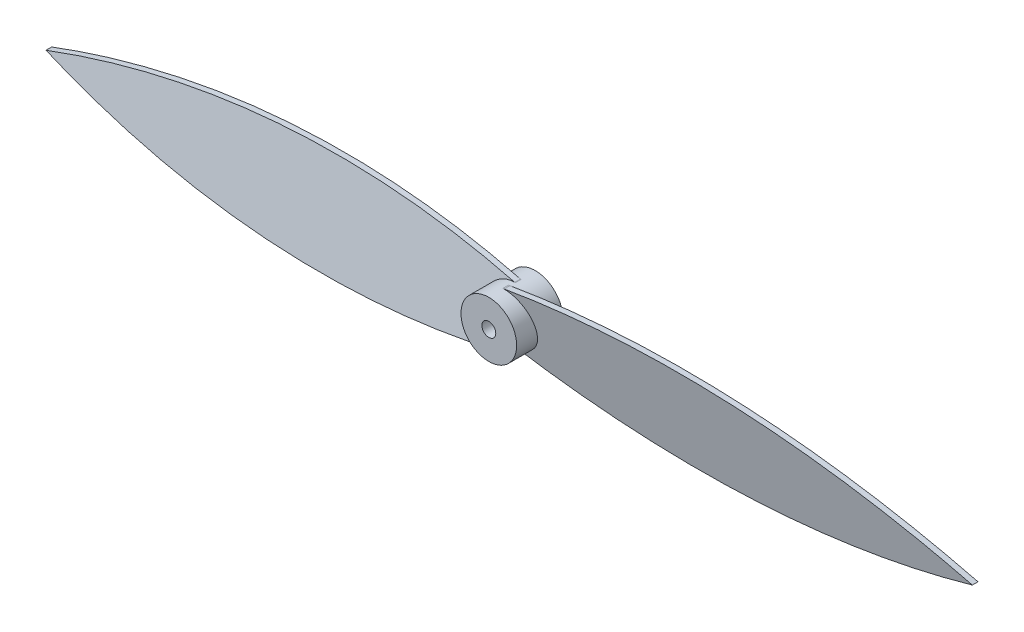
ISO-10303-21;
HEADER;
FILE_DESCRIPTION(('STEP AP214'),'2;1');
FILE_NAME('part.step','',(''),(''),'','','');
FILE_SCHEMA(('AUTOMOTIVE_DESIGN { 1 0 10303 214 1 1 1 1 }'));
ENDSEC;
DATA;
#1=APPLICATION_CONTEXT('core data for automotive mechanical design processes');
#2=APPLICATION_PROTOCOL_DEFINITION('international standard','automotive_design',2000,#1);
#3=PRODUCT_CONTEXT('',#1,'mechanical');
#4=PRODUCT('Part','Part','',(#3));
#5=PRODUCT_RELATED_PRODUCT_CATEGORY('part','',(#4));
#6=PRODUCT_DEFINITION_FORMATION('','',#4);
#7=PRODUCT_DEFINITION_CONTEXT('part definition',#1,'design');
#8=PRODUCT_DEFINITION('design','',#6,#7);
#9=PRODUCT_DEFINITION_SHAPE('','',#8);
#10=(LENGTH_UNIT() NAMED_UNIT(*) SI_UNIT(.MILLI.,.METRE.));
#11=(NAMED_UNIT(*) PLANE_ANGLE_UNIT() SI_UNIT($,.RADIAN.));
#12=(NAMED_UNIT(*) SI_UNIT($,.STERADIAN.) SOLID_ANGLE_UNIT());
#13=UNCERTAINTY_MEASURE_WITH_UNIT(LENGTH_MEASURE(1.E-05),#10,'distance_accuracy_value','');
#14=(GEOMETRIC_REPRESENTATION_CONTEXT(3) GLOBAL_UNCERTAINTY_ASSIGNED_CONTEXT((#13)) GLOBAL_UNIT_ASSIGNED_CONTEXT((#10,
#11,#12)) REPRESENTATION_CONTEXT('',''));
#15=CARTESIAN_POINT('',(0.,0.,0.));
#16=DIRECTION('',(0.,0.,1.));
#17=DIRECTION('',(1.,0.,0.));
#18=AXIS2_PLACEMENT_3D('',#15,#16,#17);
#19=CARTESIAN_POINT('',(125.,189.733037880005,0.588348405414554));
#20=DIRECTION('',(0.,0.196116135138184,-0.98058067569092));
#21=DIRECTION('',(0.,0.98058067569092,0.196116135138184));
#22=AXIS2_PLACEMENT_3D('',#19,#20,#21);
#23=PLANE('',#22);
#24=DIRECTION('',(-1.,0.,0.));
#25=VECTOR('',#24,1.);
#26=CARTESIAN_POINT('',(125.,158.850707561088,-5.58811765836887));
#27=LINE('',#26,#25);
#28=CARTESIAN_POINT('',(0.279977540218273,158.850707561088,-5.58811765836887));
#29=VERTEX_POINT('',#28);
#30=CARTESIAN_POINT('',(0.139988770109136,158.850707561088,-5.58811765836887));
#31=VERTEX_POINT('',#30);
#32=EDGE_CURVE('E211',#29,#31,#27,.T.);
#33=ORIENTED_EDGE('',*,*,#32,.F.);
#34=DIRECTION('',(0.,0.98058067569092,0.196116135138184));
#35=VECTOR('',#34,1.);
#36=CARTESIAN_POINT('',(0.279977540218274,189.733037880005,0.588348405414554));
#37=LINE('',#36,#35);
#38=CARTESIAN_POINT('',(0.279977540218274,158.821989157355,-5.59386133911546));
#39=VERTEX_POINT('',#38);
#40=EDGE_CURVE('E371',#39,#29,#37,.T.);
#41=ORIENTED_EDGE('',*,*,#40,.F.);
#42=CARTESIAN_POINT('',(38.915085389804,347.505597150109,32.1428602594354));
#43=DIRECTION('',(0.,0.196116135138184,-0.98058067569092));
#44=DIRECTION('',(0.,0.98058067569092,0.196116135138184));
#45=AXIS2_PLACEMENT_3D('',#42,#43,#44);
#46=ELLIPSE('',#45,196.412684170501,192.598482558177);
#47=CARTESIAN_POINT('',(100.,164.850707561088,-4.38811765836887));
#48=VERTEX_POINT('',#47);
#49=EDGE_CURVE('E438',#48,#39,#46,.T.);
#50=ORIENTED_EDGE('',*,*,#49,.F.);
#51=CARTESIAN_POINT('',(38.915085389804,-17.8041820279334,-40.9190955761731));
#52=DIRECTION('',(0.,0.196116135138184,-0.98058067569092));
#53=DIRECTION('',(0.,0.98058067569092,0.196116135138184));
#54=AXIS2_PLACEMENT_3D('',#51,#52,#53);
#55=ELLIPSE('',#54,196.412684170501,192.598482558177);
#56=CARTESIAN_POINT('',(0.279977540218274,170.879425964821,-3.18237397762226));
#57=VERTEX_POINT('',#56);
#58=EDGE_CURVE('E458',#48,#57,#55,.F.);
#59=ORIENTED_EDGE('',*,*,#58,.T.);
#60=DIRECTION('',(0.,0.98058067569092,0.196116135138184));
#61=VECTOR('',#60,1.);
#62=CARTESIAN_POINT('',(0.279977540218274,189.733037880005,0.588348405414554));
#63=LINE('',#62,#61);
#64=CARTESIAN_POINT('',(0.279977540218273,170.850707561088,-3.18811765836887));
#65=VERTEX_POINT('',#64);
#66=EDGE_CURVE('E377',#65,#57,#63,.T.);
#67=ORIENTED_EDGE('',*,*,#66,.F.);
#68=DIRECTION('',(1.,0.,0.));
#69=VECTOR('',#68,1.);
#70=CARTESIAN_POINT('',(125.,170.850707561088,-3.18811765836887));
#71=LINE('',#70,#69);
#72=CARTESIAN_POINT('',(0.139988770109136,170.850707561088,-3.18811765836887));
#73=VERTEX_POINT('',#72);
#74=EDGE_CURVE('E384',#73,#65,#71,.T.);
#75=ORIENTED_EDGE('',*,*,#74,.F.);
#76=CARTESIAN_POINT('',(0.139988770109136,164.850707561088,-4.38811765836887));
#77=DIRECTION('',(0.,0.196116135138184,-0.98058067569092));
#78=DIRECTION('',(0.,0.98058067569092,0.196116135138184));
#79=AXIS2_PLACEMENT_3D('',#76,#77,#78);
#80=ELLIPSE('',#79,6.11882341631134,6.);
#81=EDGE_CURVE('E244',#31,#73,#80,.F.);
#82=ORIENTED_EDGE('',*,*,#81,.F.);
#83=EDGE_LOOP('',(#33,#41,#50,#59,#67,#75,#82));
#84=FACE_BOUND('',#83,.T.);
#85=ADVANCED_FACE('F34',(#84),#23,.F.);
#86=CARTESIAN_POINT('',(125.,189.968377242171,-0.58834840541455));
#87=DIRECTION('',(0.,-0.196116135138184,0.98058067569092));
#88=DIRECTION('',(0.,-0.98058067569092,-0.196116135138184));
#89=AXIS2_PLACEMENT_3D('',#86,#87,#88);
#90=PLANE('',#89);
#91=DIRECTION('',(1.,0.,0.));
#92=VECTOR('',#91,1.);
#93=CARTESIAN_POINT('',(125.,158.850707561088,-6.81188234163113));
#94=LINE('',#93,#92);
#95=CARTESIAN_POINT('',(0.139988770109136,158.850707561088,-6.81188234163113));
#96=VERTEX_POINT('',#95);
#97=CARTESIAN_POINT('',(0.279977540218273,158.850707561088,-6.81188234163113));
#98=VERTEX_POINT('',#97);
#99=EDGE_CURVE('E199',#96,#98,#94,.T.);
#100=ORIENTED_EDGE('',*,*,#99,.F.);
#101=CARTESIAN_POINT('',(0.139988770109136,164.850707561088,-5.61188234163113));
#102=DIRECTION('',(0.,-0.196116135138184,0.98058067569092));
#103=DIRECTION('',(0.,0.98058067569092,0.196116135138184));
#104=AXIS2_PLACEMENT_3D('',#101,#102,#103);
#105=ELLIPSE('',#104,6.11882341631134,6.);
#106=CARTESIAN_POINT('',(0.139988770109136,170.850707561088,-4.41188234163113));
#107=VERTEX_POINT('',#106);
#108=EDGE_CURVE('E204',#107,#96,#105,.F.);
#109=ORIENTED_EDGE('',*,*,#108,.F.);
#110=DIRECTION('',(-1.,0.,0.));
#111=VECTOR('',#110,1.);
#112=CARTESIAN_POINT('',(125.,170.850707561088,-4.41188234163113));
#113=LINE('',#112,#111);
#114=CARTESIAN_POINT('',(0.279977540218273,170.850707561088,-4.41188234163113));
#115=VERTEX_POINT('',#114);
#116=EDGE_CURVE('E386',#115,#107,#113,.T.);
#117=ORIENTED_EDGE('',*,*,#116,.F.);
#118=DIRECTION('',(0.,-0.98058067569092,-0.196116135138184));
#119=VECTOR('',#118,1.);
#120=CARTESIAN_POINT('',(0.279977540218274,189.968377242171,-0.58834840541455));
#121=LINE('',#120,#119);
#122=CARTESIAN_POINT('',(0.279977540218274,170.879425964821,-4.40613866088452));
#123=VERTEX_POINT('',#122);
#124=EDGE_CURVE('E380',#123,#115,#121,.T.);
#125=ORIENTED_EDGE('',*,*,#124,.F.);
#126=CARTESIAN_POINT('',(38.915085389804,-17.8041820279334,-42.1428602594354));
#127=DIRECTION('',(0.,-0.196116135138184,0.98058067569092));
#128=DIRECTION('',(0.,0.98058067569092,0.196116135138184));
#129=AXIS2_PLACEMENT_3D('',#126,#127,#128);
#130=ELLIPSE('',#129,196.412684170501,192.598482558177);
#131=CARTESIAN_POINT('',(100.,164.850707561088,-5.61188234163112));
#132=VERTEX_POINT('',#131);
#133=EDGE_CURVE('E273',#123,#132,#130,.F.);
#134=ORIENTED_EDGE('',*,*,#133,.T.);
#135=CARTESIAN_POINT('',(38.915085389804,347.505597150109,30.9190955761731));
#136=DIRECTION('',(0.,-0.196116135138184,0.98058067569092));
#137=DIRECTION('',(0.,0.98058067569092,0.196116135138184));
#138=AXIS2_PLACEMENT_3D('',#135,#136,#137);
#139=ELLIPSE('',#138,196.412684170501,192.598482558177);
#140=CARTESIAN_POINT('',(0.279977540218274,158.821989157355,-6.81762602237772));
#141=VERTEX_POINT('',#140);
#142=EDGE_CURVE('E222',#141,#132,#139,.T.);
#143=ORIENTED_EDGE('',*,*,#142,.F.);
#144=DIRECTION('',(0.,-0.98058067569092,-0.196116135138184));
#145=VECTOR('',#144,1.);
#146=CARTESIAN_POINT('',(0.279977540218274,189.968377242171,-0.58834840541455));
#147=LINE('',#146,#145);
#148=EDGE_CURVE('E207',#98,#141,#147,.T.);
#149=ORIENTED_EDGE('',*,*,#148,.F.);
#150=EDGE_LOOP('',(#100,#109,#117,#125,#134,#143,#149));
#151=FACE_BOUND('',#150,.T.);
#152=ADVANCED_FACE('F201',(#151),#90,.F.);
#153=CARTESIAN_POINT('',(38.915085389804,347.505597150109,-10.5883484054145));
#154=DIRECTION('',(0.,0.,1.));
#155=DIRECTION('',(1.,0.,0.));
#156=AXIS2_PLACEMENT_3D('',#153,#154,#155);
#157=CYLINDRICAL_SURFACE('',#156,192.598482558177);
#158=ORIENTED_EDGE('',*,*,#49,.T.);
#159=DIRECTION('',(0.,0.,1.));
#160=VECTOR('',#159,1.);
#161=CARTESIAN_POINT('',(0.279977540218274,158.821989157355,-10.5883484054145));
#162=LINE('',#161,#160);
#163=EDGE_CURVE('E374',#39,#141,#162,.F.);
#164=ORIENTED_EDGE('',*,*,#163,.T.);
#165=ORIENTED_EDGE('',*,*,#142,.T.);
#166=DIRECTION('',(0.,0.,1.));
#167=VECTOR('',#166,1.);
#168=CARTESIAN_POINT('',(100.,164.850707561088,-10.5883484054145));
#169=LINE('',#168,#167);
#170=EDGE_CURVE('E324',#132,#48,#169,.T.);
#171=ORIENTED_EDGE('',*,*,#170,.T.);
#172=EDGE_LOOP('',(#158,#164,#165,#171));
#173=FACE_BOUND('',#172,.T.);
#174=ADVANCED_FACE('F511',(#173),#157,.T.);
#175=CARTESIAN_POINT('',(38.915085389804,-17.8041820279334,-10.5883484054145));
#176=DIRECTION('',(0.,0.,1.));
#177=DIRECTION('',(1.,0.,0.));
#178=AXIS2_PLACEMENT_3D('',#175,#176,#177);
#179=CYLINDRICAL_SURFACE('',#178,192.598482558177);
#180=DIRECTION('',(0.,0.,1.));
#181=VECTOR('',#180,1.);
#182=CARTESIAN_POINT('',(0.279977540218274,170.879425964821,-10.5883484054145));
#183=LINE('',#182,#181);
#184=EDGE_CURVE('E382',#57,#123,#183,.F.);
#185=ORIENTED_EDGE('',*,*,#184,.F.);
#186=ORIENTED_EDGE('',*,*,#58,.F.);
#187=ORIENTED_EDGE('',*,*,#170,.F.);
#188=ORIENTED_EDGE('',*,*,#133,.F.);
#189=EDGE_LOOP('',(#185,#186,#187,#188));
#190=FACE_BOUND('',#189,.T.);
#191=ADVANCED_FACE('F718',(#190),#179,.T.);
#192=CARTESIAN_POINT('',(0.279977540218273,329.701415122176,0.));
#193=DIRECTION('',(1.,0.,0.));
#194=DIRECTION('',(0.,0.,1.));
#195=AXIS2_PLACEMENT_3D('',#192,#193,#194);
#196=PLANE('',#195);
#197=DIRECTION('',(0.,-0.98058067569092,0.196116135138184));
#198=VECTOR('',#197,1.);
#199=CARTESIAN_POINT('',(0.279977540218273,139.733037880005,-0.58834840541455));
#200=LINE('',#199,#198);
#201=CARTESIAN_POINT('',(0.279977540218273,170.850707561088,-6.81188234163113));
#202=VERTEX_POINT('',#201);
#203=CARTESIAN_POINT('',(0.279977540218273,170.849074267471,-6.81155568290772));
#204=VERTEX_POINT('',#203);
#205=EDGE_CURVE('E357',#202,#204,#200,.T.);
#206=ORIENTED_EDGE('',*,*,#205,.F.);
#207=DIRECTION('',(0.,0.,1.));
#208=VECTOR('',#207,1.);
#209=CARTESIAN_POINT('',(0.279977540218273,170.850707561088,-10.5883484054145));
#210=LINE('',#209,#208);
#211=CARTESIAN_POINT('',(0.279977540218273,170.850707561088,-5.58811765836887));
#212=VERTEX_POINT('',#211);
#213=EDGE_CURVE('E397',#202,#212,#210,.T.);
#214=ORIENTED_EDGE('',*,*,#213,.T.);
#215=DIRECTION('',(0.,0.98058067569092,-0.196116135138184));
#216=VECTOR('',#215,1.);
#217=CARTESIAN_POINT('',(0.279977540218273,139.968377242171,0.588348405414554));
#218=LINE('',#217,#216);
#219=CARTESIAN_POINT('',(0.279977540218273,170.849074267471,-5.58779099964546));
#220=VERTEX_POINT('',#219);
#221=EDGE_CURVE('E365',#220,#212,#218,.T.);
#222=ORIENTED_EDGE('',*,*,#221,.F.);
#223=DIRECTION('',(0.,0.,1.));
#224=VECTOR('',#223,1.);
#225=CARTESIAN_POINT('',(0.279977540218273,170.849074267471,-10.));
#226=LINE('',#225,#224);
#227=EDGE_CURVE('E58',#220,#204,#226,.F.);
#228=ORIENTED_EDGE('',*,*,#227,.T.);
#229=EDGE_LOOP('',(#206,#214,#222,#228));
#230=FACE_BOUND('',#229,.T.);
#231=ADVANCED_FACE('F416',(#230),#196,.T.);
#232=CARTESIAN_POINT('',(-124.720022459782,139.968377242171,0.588348405414554));
#233=DIRECTION('',(0.,-0.196116135138184,-0.98058067569092));
#234=DIRECTION('',(0.,0.98058067569092,-0.196116135138184));
#235=AXIS2_PLACEMENT_3D('',#232,#233,#234);
#236=PLANE('',#235);
#237=DIRECTION('',(-1.,0.,0.));
#238=VECTOR('',#237,1.);
#239=CARTESIAN_POINT('',(-124.720022459782,158.850707561088,-3.18811765836887));
#240=LINE('',#239,#238);
#241=CARTESIAN_POINT('',(0.279977540218273,158.850707561088,-3.18811765836887));
#242=VERTEX_POINT('',#241);
#243=CARTESIAN_POINT('',(0.139988770109136,158.850707561088,-3.18811765836887));
#244=VERTEX_POINT('',#243);
#245=EDGE_CURVE('E212',#242,#244,#240,.T.);
#246=ORIENTED_EDGE('',*,*,#245,.F.);
#247=CARTESIAN_POINT('',(0.279977540218273,158.852340854705,-3.18844431709228));
#248=VERTEX_POINT('',#247);
#249=EDGE_CURVE('E361',#242,#248,#218,.T.);
#250=ORIENTED_EDGE('',*,*,#249,.T.);
#251=CARTESIAN_POINT('',(0.139988770109136,164.850707561088,-4.38811765836887));
#252=DIRECTION('',(0.,-0.196116135138184,-0.98058067569092));
#253=DIRECTION('',(0.,-0.98058067569092,0.196116135138184));
#254=AXIS2_PLACEMENT_3D('',#251,#252,#253);
#255=ELLIPSE('',#254,6.11882341631134,6.);
#256=EDGE_CURVE('E340',#244,#248,#255,.F.);
#257=ORIENTED_EDGE('',*,*,#256,.F.);
#258=EDGE_LOOP('',(#246,#250,#257));
#259=FACE_BOUND('',#258,.T.);
#260=ADVANCED_FACE('F406',(#259),#236,.F.);
#261=DIRECTION('',(1.,0.,0.));
#262=VECTOR('',#261,1.);
#263=CARTESIAN_POINT('',(-124.720022459782,170.850707561088,-5.58811765836887));
#264=LINE('',#263,#262);
#265=CARTESIAN_POINT('',(0.139988770109136,170.850707561088,-5.58811765836887));
#266=VERTEX_POINT('',#265);
#267=EDGE_CURVE('E388',#266,#212,#264,.T.);
#268=ORIENTED_EDGE('',*,*,#267,.F.);
#269=EDGE_CURVE('E335',#220,#266,#255,.F.);
#270=ORIENTED_EDGE('',*,*,#269,.F.);
#271=ORIENTED_EDGE('',*,*,#221,.T.);
#272=EDGE_LOOP('',(#268,#270,#271));
#273=FACE_BOUND('',#272,.T.);
#274=ADVANCED_FACE('F412',(#273),#236,.F.);
#275=CARTESIAN_POINT('',(-124.720022459782,139.733037880005,-0.58834840541455));
#276=DIRECTION('',(0.,0.196116135138184,0.98058067569092));
#277=DIRECTION('',(0.,-0.98058067569092,0.196116135138184));
#278=AXIS2_PLACEMENT_3D('',#275,#276,#277);
#279=PLANE('',#278);
#280=DIRECTION('',(1.,0.,0.));
#281=VECTOR('',#280,1.);
#282=CARTESIAN_POINT('',(-124.720022459782,158.850707561088,-4.41188234163113));
#283=LINE('',#282,#281);
#284=CARTESIAN_POINT('',(0.139988770109136,158.850707561088,-4.41188234163113));
#285=VERTEX_POINT('',#284);
#286=CARTESIAN_POINT('',(0.279977540218273,158.850707561088,-4.41188234163113));
#287=VERTEX_POINT('',#286);
#288=EDGE_CURVE('E50',#285,#287,#283,.T.);
#289=ORIENTED_EDGE('',*,*,#288,.F.);
#290=CARTESIAN_POINT('',(0.139988770109136,164.850707561088,-5.61188234163113));
#291=DIRECTION('',(0.,0.196116135138184,0.98058067569092));
#292=DIRECTION('',(0.,-0.98058067569092,0.196116135138184));
#293=AXIS2_PLACEMENT_3D('',#290,#291,#292);
#294=ELLIPSE('',#293,6.11882341631134,6.);
#295=CARTESIAN_POINT('',(0.279977540218273,158.852340854705,-4.41220900035454));
#296=VERTEX_POINT('',#295);
#297=EDGE_CURVE('E314',#296,#285,#294,.F.);
#298=ORIENTED_EDGE('',*,*,#297,.F.);
#299=EDGE_CURVE('E360',#296,#287,#200,.T.);
#300=ORIENTED_EDGE('',*,*,#299,.T.);
#301=EDGE_LOOP('',(#289,#298,#300));
#302=FACE_BOUND('',#301,.T.);
#303=ADVANCED_FACE('F491',(#302),#279,.F.);
#304=DIRECTION('',(-1.,0.,0.));
#305=VECTOR('',#304,1.);
#306=CARTESIAN_POINT('',(-124.720022459782,170.850707561088,-6.81188234163113));
#307=LINE('',#306,#305);
#308=CARTESIAN_POINT('',(0.139988770109136,170.850707561088,-6.81188234163113));
#309=VERTEX_POINT('',#308);
#310=EDGE_CURVE('E286',#202,#309,#307,.T.);
#311=ORIENTED_EDGE('',*,*,#310,.F.);
#312=ORIENTED_EDGE('',*,*,#205,.T.);
#313=EDGE_CURVE('E315',#309,#204,#294,.F.);
#314=ORIENTED_EDGE('',*,*,#313,.F.);
#315=EDGE_LOOP('',(#311,#312,#314));
#316=FACE_BOUND('',#315,.T.);
#317=ADVANCED_FACE('F653',(#316),#279,.F.);
#318=ORIENTED_EDGE('',*,*,#249,.F.);
#319=DIRECTION('',(0.,0.,-1.));
#320=VECTOR('',#319,1.);
#321=CARTESIAN_POINT('',(0.279977540218273,158.850707561088,0.));
#322=LINE('',#321,#320);
#323=EDGE_CURVE('E284',#242,#287,#322,.T.);
#324=ORIENTED_EDGE('',*,*,#323,.T.);
#325=ORIENTED_EDGE('',*,*,#299,.F.);
#326=DIRECTION('',(0.,0.,1.));
#327=VECTOR('',#326,1.);
#328=CARTESIAN_POINT('',(0.279977540218273,158.852340854705,-10.));
#329=LINE('',#328,#327);
#330=EDGE_CURVE('E320',#296,#248,#329,.T.);
#331=ORIENTED_EDGE('',*,*,#330,.T.);
#332=EDGE_LOOP('',(#318,#324,#325,#331));
#333=FACE_BOUND('',#332,.T.);
#334=ADVANCED_FACE('F493',(#333),#196,.T.);
#335=CARTESIAN_POINT('',(0.139988770109136,164.850707561088,-10.));
#336=DIRECTION('',(0.,0.,1.));
#337=DIRECTION('',(1.,0.,0.));
#338=AXIS2_PLACEMENT_3D('',#335,#336,#337);
#339=CYLINDRICAL_SURFACE('',#338,1.49999999999999);
#340=CARTESIAN_POINT('',(0.139988770109136,164.850707561088,-10.));
#341=DIRECTION('',(0.,0.,1.));
#342=DIRECTION('',(1.,0.,0.));
#343=AXIS2_PLACEMENT_3D('',#340,#341,#342);
#344=CIRCLE('',#343,1.49999999999999);
#345=CARTESIAN_POINT('',(1.63998877010913,164.850707561088,-10.));
#346=VERTEX_POINT('',#345);
#347=EDGE_CURVE('E245',#346,#346,#344,.T.);
#348=ORIENTED_EDGE('',*,*,#347,.F.);
#349=EDGE_LOOP('',(#348));
#350=FACE_BOUND('',#349,.T.);
#351=CARTESIAN_POINT('',(0.139988770109136,164.850707561088,-5.61188234163113));
#352=DIRECTION('',(0.,0.196116135138184,0.98058067569092));
#353=DIRECTION('',(0.,-0.98058067569092,0.196116135138184));
#354=AXIS2_PLACEMENT_3D('',#351,#352,#353);
#355=ELLIPSE('',#354,1.52970585407783,1.49999999999999);
#356=CARTESIAN_POINT('',(0.,163.357254132205,-5.31319165585448));
#357=VERTEX_POINT('',#356);
#358=CARTESIAN_POINT('',(0.279977540218273,166.344160989971,-5.91057302740779));
#359=VERTEX_POINT('',#358);
#360=EDGE_CURVE('E328',#357,#359,#355,.F.);
#361=ORIENTED_EDGE('',*,*,#360,.F.);
#362=DIRECTION('',(0.,0.,1.));
#363=VECTOR('',#362,1.);
#364=CARTESIAN_POINT('',(0.,163.357254132205,-10.));
#365=LINE('',#364,#363);
#366=CARTESIAN_POINT('',(0.,163.357254132205,-5.91057302740779));
#367=VERTEX_POINT('',#366);
#368=EDGE_CURVE('E268',#357,#367,#365,.F.);
#369=ORIENTED_EDGE('',*,*,#368,.T.);
#370=CARTESIAN_POINT('',(0.139988770109136,164.850707561088,-5.61188234163113));
#371=DIRECTION('',(0.,-0.196116135138184,0.98058067569092));
#372=DIRECTION('',(0.,0.98058067569092,0.196116135138184));
#373=AXIS2_PLACEMENT_3D('',#370,#371,#372);
#374=ELLIPSE('',#373,1.52970585407783,1.49999999999999);
#375=CARTESIAN_POINT('',(0.279977540218274,166.344160989971,-5.31319165585447));
#376=VERTEX_POINT('',#375);
#377=EDGE_CURVE('E261',#376,#367,#374,.F.);
#378=ORIENTED_EDGE('',*,*,#377,.F.);
#379=DIRECTION('',(0.,0.,1.));
#380=VECTOR('',#379,1.);
#381=CARTESIAN_POINT('',(0.279977540218273,166.344160989971,-10.));
#382=LINE('',#381,#380);
#383=EDGE_CURVE('E348',#376,#359,#382,.F.);
#384=ORIENTED_EDGE('',*,*,#383,.T.);
#385=EDGE_LOOP('',(#361,#369,#378,#384));
#386=FACE_BOUND('',#385,.T.);
#387=ADVANCED_FACE('F488',(#350,#386),#339,.F.);
#388=CARTESIAN_POINT('',(0.139988770109136,164.850707561088,0.));
#389=DIRECTION('',(0.,0.,1.));
#390=DIRECTION('',(1.,0.,0.));
#391=AXIS2_PLACEMENT_3D('',#388,#389,#390);
#392=CIRCLE('',#391,1.49999999999999);
#393=CARTESIAN_POINT('',(1.63998877010913,164.850707561088,0.));
#394=VERTEX_POINT('',#393);
#395=EDGE_CURVE('E243',#394,#394,#392,.T.);
#396=ORIENTED_EDGE('',*,*,#395,.T.);
#397=EDGE_LOOP('',(#396));
#398=FACE_BOUND('',#397,.T.);
#399=CARTESIAN_POINT('',(0.139988770109136,164.850707561088,-4.38811765836887));
#400=DIRECTION('',(0.,-0.196116135138184,-0.98058067569092));
#401=DIRECTION('',(0.,-0.98058067569092,0.196116135138184));
#402=AXIS2_PLACEMENT_3D('',#399,#400,#401);
#403=ELLIPSE('',#402,1.52970585407783,1.49999999999999);
#404=CARTESIAN_POINT('',(0.,166.344160989971,-4.68680834414553));
#405=VERTEX_POINT('',#404);
#406=CARTESIAN_POINT('',(0.279977540218273,163.357254132205,-4.08942697259221));
#407=VERTEX_POINT('',#406);
#408=EDGE_CURVE('E341',#405,#407,#403,.F.);
#409=ORIENTED_EDGE('',*,*,#408,.F.);
#410=DIRECTION('',(0.,0.,1.));
#411=VECTOR('',#410,1.);
#412=CARTESIAN_POINT('',(0.,166.344160989971,-10.));
#413=LINE('',#412,#411);
#414=CARTESIAN_POINT('',(0.,166.344160989971,-4.08942697259221));
#415=VERTEX_POINT('',#414);
#416=EDGE_CURVE('E256',#405,#415,#413,.T.);
#417=ORIENTED_EDGE('',*,*,#416,.T.);
#418=CARTESIAN_POINT('',(0.139988770109136,164.850707561088,-4.38811765836887));
#419=DIRECTION('',(0.,0.196116135138184,-0.98058067569092));
#420=DIRECTION('',(0.,0.98058067569092,0.196116135138184));
#421=AXIS2_PLACEMENT_3D('',#418,#419,#420);
#422=ELLIPSE('',#421,1.52970585407783,1.49999999999999);
#423=CARTESIAN_POINT('',(0.279977540218274,163.357254132205,-4.68680834414553));
#424=VERTEX_POINT('',#423);
#425=EDGE_CURVE('E264',#424,#415,#422,.F.);
#426=ORIENTED_EDGE('',*,*,#425,.F.);
#427=DIRECTION('',(0.,0.,1.));
#428=VECTOR('',#427,1.);
#429=CARTESIAN_POINT('',(0.279977540218273,163.357254132205,-10.));
#430=LINE('',#429,#428);
#431=EDGE_CURVE('E354',#424,#407,#430,.T.);
#432=ORIENTED_EDGE('',*,*,#431,.T.);
#433=EDGE_LOOP('',(#409,#417,#426,#432));
#434=FACE_BOUND('',#433,.T.);
#435=ADVANCED_FACE('F529',(#398,#434),#339,.F.);
#436=CARTESIAN_POINT('',(0.,0.,0.));
#437=DIRECTION('',(-1.,0.,0.));
#438=DIRECTION('',(0.,0.,1.));
#439=AXIS2_PLACEMENT_3D('',#436,#437,#438);
#440=PLANE('',#439);
#441=ORIENTED_EDGE('',*,*,#416,.F.);
#442=DIRECTION('',(0.,-0.98058067569092,0.196116135138184));
#443=VECTOR('',#442,1.);
#444=CARTESIAN_POINT('',(0.,5.49654304881707,27.4827152440853));
#445=LINE('',#444,#443);
#446=CARTESIAN_POINT('',(0.,164.850707561088,-4.38811765836887));
#447=VERTEX_POINT('',#446);
#448=EDGE_CURVE('E343',#405,#447,#445,.T.);
#449=ORIENTED_EDGE('',*,*,#448,.T.);
#450=DIRECTION('',(0.,-0.98058067569092,-0.196116135138184));
#451=VECTOR('',#450,1.);
#452=CARTESIAN_POINT('',(0.,189.733037880005,0.588348405414554));
#453=LINE('',#452,#451);
#454=EDGE_CURVE('E429',#415,#447,#453,.T.);
#455=ORIENTED_EDGE('',*,*,#454,.F.);
#456=EDGE_LOOP('',(#441,#449,#455));
#457=FACE_BOUND('',#456,.T.);
#458=ADVANCED_FACE('F524',(#457),#440,.T.);
#459=ORIENTED_EDGE('',*,*,#368,.F.);
#460=DIRECTION('',(0.,0.98058067569092,-0.196116135138184));
#461=VECTOR('',#460,1.);
#462=CARTESIAN_POINT('',(0.,5.26120368665124,26.3060184332562));
#463=LINE('',#462,#461);
#464=CARTESIAN_POINT('',(0.,164.850707561088,-5.61188234163113));
#465=VERTEX_POINT('',#464);
#466=EDGE_CURVE('E329',#357,#465,#463,.T.);
#467=ORIENTED_EDGE('',*,*,#466,.T.);
#468=DIRECTION('',(0.,0.98058067569092,0.196116135138184));
#469=VECTOR('',#468,1.);
#470=CARTESIAN_POINT('',(0.,189.968377242171,-0.58834840541455));
#471=LINE('',#470,#469);
#472=EDGE_CURVE('E443',#367,#465,#471,.T.);
#473=ORIENTED_EDGE('',*,*,#472,.F.);
#474=EDGE_LOOP('',(#459,#467,#473));
#475=FACE_BOUND('',#474,.T.);
#476=ADVANCED_FACE('F485',(#475),#440,.T.);
#477=DIRECTION('',(-1.,0.,0.));
#478=VECTOR('',#477,1.);
#479=CARTESIAN_POINT('',(125.,164.850707561088,-5.61188234163113));
#480=LINE('',#479,#478);
#481=CARTESIAN_POINT('',(0.279977540218273,164.850707561088,-5.61188234163113));
#482=VERTEX_POINT('',#481);
#483=EDGE_CURVE('E282',#482,#465,#480,.T.);
#484=ORIENTED_EDGE('',*,*,#483,.F.);
#485=DIRECTION('',(0.,0.98058067569092,0.196116135138184));
#486=VECTOR('',#485,1.);
#487=CARTESIAN_POINT('',(0.279977540218274,189.968377242171,-0.58834840541455));
#488=LINE('',#487,#486);
#489=EDGE_CURVE('E351',#482,#376,#488,.T.);
#490=ORIENTED_EDGE('',*,*,#489,.T.);
#491=ORIENTED_EDGE('',*,*,#377,.T.);
#492=ORIENTED_EDGE('',*,*,#472,.T.);
#493=EDGE_LOOP('',(#484,#490,#491,#492));
#494=FACE_BOUND('',#493,.T.);
#495=ADVANCED_FACE('F481',(#494),#90,.F.);
#496=DIRECTION('',(-1.,0.,0.));
#497=VECTOR('',#496,1.);
#498=CARTESIAN_POINT('',(125.,164.850707561088,-4.38811765836887));
#499=LINE('',#498,#497);
#500=CARTESIAN_POINT('',(0.279977540218273,164.850707561088,-4.38811765836887));
#501=VERTEX_POINT('',#500);
#502=EDGE_CURVE('E280',#501,#447,#499,.T.);
#503=ORIENTED_EDGE('',*,*,#502,.F.);
#504=DIRECTION('',(0.,-0.98058067569092,-0.196116135138184));
#505=VECTOR('',#504,1.);
#506=CARTESIAN_POINT('',(0.279977540218274,189.733037880005,0.588348405414554));
#507=LINE('',#506,#505);
#508=EDGE_CURVE('E277',#501,#424,#507,.T.);
#509=ORIENTED_EDGE('',*,*,#508,.T.);
#510=ORIENTED_EDGE('',*,*,#425,.T.);
#511=ORIENTED_EDGE('',*,*,#454,.T.);
#512=EDGE_LOOP('',(#503,#509,#510,#511));
#513=FACE_BOUND('',#512,.T.);
#514=ADVANCED_FACE('F426',(#513),#23,.F.);
#515=CARTESIAN_POINT('',(0.,158.850707561088,-6.81188234163113));
#516=VERTEX_POINT('',#515);
#517=CARTESIAN_POINT('',(0.,158.852340854705,-6.81155568290772));
#518=VERTEX_POINT('',#517);
#519=EDGE_CURVE('E228',#516,#518,#471,.T.);
#520=ORIENTED_EDGE('',*,*,#519,.F.);
#521=DIRECTION('',(0.,0.,1.));
#522=VECTOR('',#521,1.);
#523=CARTESIAN_POINT('',(0.,158.850707561088,-10.5883484054145));
#524=LINE('',#523,#522);
#525=CARTESIAN_POINT('',(0.,158.850707561088,-5.58811765836887));
#526=VERTEX_POINT('',#525);
#527=EDGE_CURVE('E219',#516,#526,#524,.T.);
#528=ORIENTED_EDGE('',*,*,#527,.T.);
#529=CARTESIAN_POINT('',(0.,158.852340854705,-5.58779099964546));
#530=VERTEX_POINT('',#529);
#531=EDGE_CURVE('E433',#530,#526,#453,.T.);
#532=ORIENTED_EDGE('',*,*,#531,.F.);
#533=DIRECTION('',(0.,0.,1.));
#534=VECTOR('',#533,1.);
#535=CARTESIAN_POINT('',(0.,158.852340854705,-10.));
#536=LINE('',#535,#534);
#537=EDGE_CURVE('E231',#530,#518,#536,.F.);
#538=ORIENTED_EDGE('',*,*,#537,.T.);
#539=EDGE_LOOP('',(#520,#528,#532,#538));
#540=FACE_BOUND('',#539,.T.);
#541=ADVANCED_FACE('F450',(#540),#440,.T.);
#542=DIRECTION('',(1.,0.,0.));
#543=VECTOR('',#542,1.);
#544=CARTESIAN_POINT('',(125.,170.850707561088,-3.18811765836887));
#545=LINE('',#544,#543);
#546=CARTESIAN_POINT('',(0.,170.850707561088,-3.18811765836887));
#547=VERTEX_POINT('',#546);
#548=EDGE_CURVE('E459',#547,#73,#545,.T.);
#549=ORIENTED_EDGE('',*,*,#548,.F.);
#550=CARTESIAN_POINT('',(0.,170.849074267471,-3.18844431709228));
#551=VERTEX_POINT('',#550);
#552=EDGE_CURVE('E432',#547,#551,#453,.T.);
#553=ORIENTED_EDGE('',*,*,#552,.T.);
#554=EDGE_CURVE('E237',#73,#551,#80,.F.);
#555=ORIENTED_EDGE('',*,*,#554,.F.);
#556=EDGE_LOOP('',(#549,#553,#555));
#557=FACE_BOUND('',#556,.T.);
#558=ADVANCED_FACE('F469',(#557),#23,.F.);
#559=DIRECTION('',(-1.,0.,0.));
#560=VECTOR('',#559,1.);
#561=CARTESIAN_POINT('',(125.,158.850707561088,-5.58811765836887));
#562=LINE('',#561,#560);
#563=EDGE_CURVE('E456',#31,#526,#562,.T.);
#564=ORIENTED_EDGE('',*,*,#563,.F.);
#565=EDGE_CURVE('E241',#530,#31,#80,.F.);
#566=ORIENTED_EDGE('',*,*,#565,.F.);
#567=ORIENTED_EDGE('',*,*,#531,.T.);
#568=EDGE_LOOP('',(#564,#566,#567));
#569=FACE_BOUND('',#568,.T.);
#570=ADVANCED_FACE('F455',(#569),#23,.F.);
#571=DIRECTION('',(-1.,0.,0.));
#572=VECTOR('',#571,1.);
#573=CARTESIAN_POINT('',(125.,170.850707561088,-4.41188234163113));
#574=LINE('',#573,#572);
#575=CARTESIAN_POINT('',(0.,170.850707561088,-4.41188234163113));
#576=VERTEX_POINT('',#575);
#577=EDGE_CURVE('E476',#107,#576,#574,.T.);
#578=ORIENTED_EDGE('',*,*,#577,.F.);
#579=CARTESIAN_POINT('',(0.,170.849074267471,-4.41220900035454));
#580=VERTEX_POINT('',#579);
#581=EDGE_CURVE('E233',#580,#107,#105,.F.);
#582=ORIENTED_EDGE('',*,*,#581,.F.);
#583=EDGE_CURVE('E436',#580,#576,#471,.T.);
#584=ORIENTED_EDGE('',*,*,#583,.T.);
#585=EDGE_LOOP('',(#578,#582,#584));
#586=FACE_BOUND('',#585,.T.);
#587=ADVANCED_FACE('F475',(#586),#90,.F.);
#588=DIRECTION('',(1.,0.,0.));
#589=VECTOR('',#588,1.);
#590=CARTESIAN_POINT('',(125.,158.850707561088,-6.81188234163113));
#591=LINE('',#590,#589);
#592=EDGE_CURVE('E215',#516,#96,#591,.T.);
#593=ORIENTED_EDGE('',*,*,#592,.F.);
#594=ORIENTED_EDGE('',*,*,#519,.T.);
#595=EDGE_CURVE('E226',#96,#518,#105,.F.);
#596=ORIENTED_EDGE('',*,*,#595,.F.);
#597=EDGE_LOOP('',(#593,#594,#596));
#598=FACE_BOUND('',#597,.T.);
#599=ADVANCED_FACE('F227',(#598),#90,.F.);
#600=ORIENTED_EDGE('',*,*,#552,.F.);
#601=DIRECTION('',(0.,0.,-1.));
#602=VECTOR('',#601,1.);
#603=CARTESIAN_POINT('',(0.,170.850707561088,0.));
#604=LINE('',#603,#602);
#605=EDGE_CURVE('E223',#547,#576,#604,.T.);
#606=ORIENTED_EDGE('',*,*,#605,.T.);
#607=ORIENTED_EDGE('',*,*,#583,.F.);
#608=DIRECTION('',(0.,0.,1.));
#609=VECTOR('',#608,1.);
#610=CARTESIAN_POINT('',(0.,170.849074267471,-10.));
#611=LINE('',#610,#609);
#612=EDGE_CURVE('E442',#580,#551,#611,.T.);
#613=ORIENTED_EDGE('',*,*,#612,.T.);
#614=EDGE_LOOP('',(#600,#606,#607,#613));
#615=FACE_BOUND('',#614,.T.);
#616=ADVANCED_FACE('F470',(#615),#440,.T.);
#617=CARTESIAN_POINT('',(0.139988770109136,164.850707561088,-10.));
#618=DIRECTION('',(0.,0.,1.));
#619=DIRECTION('',(1.,0.,0.));
#620=AXIS2_PLACEMENT_3D('',#617,#618,#619);
#621=CYLINDRICAL_SURFACE('',#620,6.);
#622=EDGE_CURVE('E339',#266,#244,#255,.F.);
#623=ORIENTED_EDGE('',*,*,#622,.T.);
#624=ORIENTED_EDGE('',*,*,#256,.T.);
#625=ORIENTED_EDGE('',*,*,#330,.F.);
#626=ORIENTED_EDGE('',*,*,#297,.T.);
#627=EDGE_CURVE('E312',#285,#309,#294,.F.);
#628=ORIENTED_EDGE('',*,*,#627,.T.);
#629=ORIENTED_EDGE('',*,*,#313,.T.);
#630=ORIENTED_EDGE('',*,*,#227,.F.);
#631=ORIENTED_EDGE('',*,*,#269,.T.);
#632=EDGE_LOOP('',(#623,#624,#625,#626,#628,#629,#630,#631));
#633=FACE_BOUND('',#632,.T.);
#634=ORIENTED_EDGE('',*,*,#565,.T.);
#635=ORIENTED_EDGE('',*,*,#81,.T.);
#636=ORIENTED_EDGE('',*,*,#554,.T.);
#637=ORIENTED_EDGE('',*,*,#612,.F.);
#638=ORIENTED_EDGE('',*,*,#581,.T.);
#639=ORIENTED_EDGE('',*,*,#108,.T.);
#640=ORIENTED_EDGE('',*,*,#595,.T.);
#641=ORIENTED_EDGE('',*,*,#537,.F.);
#642=EDGE_LOOP('',(#634,#635,#636,#637,#638,#639,#640,#641));
#643=FACE_BOUND('',#642,.T.);
#644=CARTESIAN_POINT('',(0.139988770109136,164.850707561088,-10.));
#645=DIRECTION('',(0.,0.,1.));
#646=DIRECTION('',(1.,0.,0.));
#647=AXIS2_PLACEMENT_3D('',#644,#645,#646);
#648=CIRCLE('',#647,6.);
#649=CARTESIAN_POINT('',(6.13998877010914,164.850707561088,-10.));
#650=VERTEX_POINT('',#649);
#651=EDGE_CURVE('E252',#650,#650,#648,.T.);
#652=ORIENTED_EDGE('',*,*,#651,.T.);
#653=EDGE_LOOP('',(#652));
#654=FACE_BOUND('',#653,.T.);
#655=CARTESIAN_POINT('',(0.139988770109136,164.850707561088,0.));
#656=DIRECTION('',(0.,0.,1.));
#657=DIRECTION('',(1.,0.,0.));
#658=AXIS2_PLACEMENT_3D('',#655,#656,#657);
#659=CIRCLE('',#658,6.);
#660=CARTESIAN_POINT('',(6.13998877010914,164.850707561088,0.));
#661=VERTEX_POINT('',#660);
#662=EDGE_CURVE('E249',#661,#661,#659,.T.);
#663=ORIENTED_EDGE('',*,*,#662,.F.);
#664=EDGE_LOOP('',(#663));
#665=FACE_BOUND('',#664,.T.);
#666=ADVANCED_FACE('F36',(#633,#643,#654,#665),#621,.T.);
#667=CARTESIAN_POINT('',(0.139988770109136,164.850707561088,-10.));
#668=DIRECTION('',(0.,0.,1.));
#669=DIRECTION('',(1.,0.,0.));
#670=AXIS2_PLACEMENT_3D('',#667,#668,#669);
#671=PLANE('',#670);
#672=ORIENTED_EDGE('',*,*,#347,.T.);
#673=EDGE_LOOP('',(#672));
#674=FACE_BOUND('',#673,.T.);
#675=ORIENTED_EDGE('',*,*,#651,.F.);
#676=EDGE_LOOP('',(#675));
#677=FACE_BOUND('',#676,.T.);
#678=ADVANCED_FACE('F535',(#674,#677),#671,.F.);
#679=CARTESIAN_POINT('',(0.139988770109136,164.850707561088,0.));
#680=DIRECTION('',(0.,0.,1.));
#681=DIRECTION('',(1.,0.,0.));
#682=AXIS2_PLACEMENT_3D('',#679,#680,#681);
#683=PLANE('',#682);
#684=ORIENTED_EDGE('',*,*,#395,.F.);
#685=EDGE_LOOP('',(#684));
#686=FACE_BOUND('',#685,.T.);
#687=ORIENTED_EDGE('',*,*,#662,.T.);
#688=EDGE_LOOP('',(#687));
#689=FACE_BOUND('',#688,.T.);
#690=ADVANCED_FACE('F586',(#686,#689),#683,.T.);
#691=CARTESIAN_POINT('',(0.,158.850707561088,-10.5883484054145));
#692=DIRECTION('',(0.,-1.,0.));
#693=DIRECTION('',(0.,0.,-1.));
#694=AXIS2_PLACEMENT_3D('',#691,#692,#693);
#695=PLANE('',#694);
#696=ORIENTED_EDGE('',*,*,#563,.T.);
#697=ORIENTED_EDGE('',*,*,#527,.F.);
#698=ORIENTED_EDGE('',*,*,#592,.T.);
#699=ORIENTED_EDGE('',*,*,#99,.T.);
#700=DIRECTION('',(0.,0.,1.));
#701=VECTOR('',#700,1.);
#702=CARTESIAN_POINT('',(0.279977540218273,158.850707561088,-10.5883484054145));
#703=LINE('',#702,#701);
#704=EDGE_CURVE('E398',#98,#29,#703,.T.);
#705=ORIENTED_EDGE('',*,*,#704,.T.);
#706=ORIENTED_EDGE('',*,*,#32,.T.);
#707=EDGE_LOOP('',(#696,#697,#698,#699,#705,#706));
#708=FACE_BOUND('',#707,.T.);
#709=ADVANCED_FACE('F217',(#708),#695,.T.);
#710=CARTESIAN_POINT('',(0.,170.850707561088,-10.5883484054145));
#711=DIRECTION('',(0.,1.,0.));
#712=DIRECTION('',(0.,0.,1.));
#713=AXIS2_PLACEMENT_3D('',#710,#711,#712);
#714=PLANE('',#713);
#715=ORIENTED_EDGE('',*,*,#548,.T.);
#716=ORIENTED_EDGE('',*,*,#74,.T.);
#717=EDGE_CURVE('E394',#115,#65,#210,.T.);
#718=ORIENTED_EDGE('',*,*,#717,.F.);
#719=ORIENTED_EDGE('',*,*,#116,.T.);
#720=ORIENTED_EDGE('',*,*,#577,.T.);
#721=ORIENTED_EDGE('',*,*,#605,.F.);
#722=EDGE_LOOP('',(#715,#716,#718,#719,#720,#721));
#723=FACE_BOUND('',#722,.T.);
#724=ADVANCED_FACE('F607',(#723),#714,.T.);
#725=ORIENTED_EDGE('',*,*,#431,.F.);
#726=ORIENTED_EDGE('',*,*,#508,.F.);
#727=EDGE_CURVE('E364',#407,#501,#218,.T.);
#728=ORIENTED_EDGE('',*,*,#727,.F.);
#729=EDGE_LOOP('',(#725,#726,#728));
#730=FACE_BOUND('',#729,.T.);
#731=ADVANCED_FACE('F618',(#730),#196,.T.);
#732=ORIENTED_EDGE('',*,*,#448,.F.);
#733=ORIENTED_EDGE('',*,*,#408,.T.);
#734=ORIENTED_EDGE('',*,*,#727,.T.);
#735=ORIENTED_EDGE('',*,*,#502,.T.);
#736=EDGE_LOOP('',(#732,#733,#734,#735));
#737=FACE_BOUND('',#736,.T.);
#738=ADVANCED_FACE('F421',(#737),#236,.F.);
#739=ORIENTED_EDGE('',*,*,#383,.F.);
#740=ORIENTED_EDGE('',*,*,#489,.F.);
#741=EDGE_CURVE('E359',#359,#482,#200,.T.);
#742=ORIENTED_EDGE('',*,*,#741,.F.);
#743=EDGE_LOOP('',(#739,#740,#742));
#744=FACE_BOUND('',#743,.T.);
#745=ADVANCED_FACE('F490',(#744),#196,.T.);
#746=ORIENTED_EDGE('',*,*,#466,.F.);
#747=ORIENTED_EDGE('',*,*,#360,.T.);
#748=ORIENTED_EDGE('',*,*,#741,.T.);
#749=ORIENTED_EDGE('',*,*,#483,.T.);
#750=EDGE_LOOP('',(#746,#747,#748,#749));
#751=FACE_BOUND('',#750,.T.);
#752=ADVANCED_FACE('F486',(#751),#279,.F.);
#753=CARTESIAN_POINT('',(-38.6351078495858,-17.8041820279334,32.1428602594354));
#754=DIRECTION('',(0.,-0.196116135138184,-0.98058067569092));
#755=DIRECTION('',(0.,-0.98058067569092,0.196116135138184));
#756=AXIS2_PLACEMENT_3D('',#753,#754,#755);
#757=ELLIPSE('',#756,196.412684170501,192.598482558177);
#758=CARTESIAN_POINT('',(-99.7200224597817,164.850707561088,-4.38811765836887));
#759=VERTEX_POINT('',#758);
#760=EDGE_CURVE('E366',#759,#266,#757,.T.);
#761=ORIENTED_EDGE('',*,*,#760,.F.);
#762=CARTESIAN_POINT('',(-38.6351078495858,347.505597150109,-40.9190955761732));
#763=DIRECTION('',(0.,-0.196116135138184,-0.98058067569092));
#764=DIRECTION('',(0.,-0.98058067569092,0.196116135138184));
#765=AXIS2_PLACEMENT_3D('',#762,#763,#764);
#766=ELLIPSE('',#765,196.412684170501,192.598482558177);
#767=EDGE_CURVE('E307',#759,#244,#766,.F.);
#768=ORIENTED_EDGE('',*,*,#767,.T.);
#769=ORIENTED_EDGE('',*,*,#622,.F.);
#770=EDGE_LOOP('',(#761,#768,#769));
#771=FACE_BOUND('',#770,.T.);
#772=ADVANCED_FACE('F403',(#771),#236,.F.);
#773=ORIENTED_EDGE('',*,*,#627,.F.);
#774=CARTESIAN_POINT('',(-38.6351078495858,347.505597150109,-42.1428602594354));
#775=DIRECTION('',(0.,0.196116135138184,0.98058067569092));
#776=DIRECTION('',(0.,-0.98058067569092,0.196116135138184));
#777=AXIS2_PLACEMENT_3D('',#774,#775,#776);
#778=ELLIPSE('',#777,196.412684170501,192.598482558177);
#779=CARTESIAN_POINT('',(-99.7200224597817,164.850707561088,-5.61188234163114));
#780=VERTEX_POINT('',#779);
#781=EDGE_CURVE('E11',#285,#780,#778,.F.);
#782=ORIENTED_EDGE('',*,*,#781,.T.);
#783=CARTESIAN_POINT('',(-38.6351078495858,-17.8041820279334,30.9190955761731));
#784=DIRECTION('',(0.,0.196116135138184,0.98058067569092));
#785=DIRECTION('',(0.,-0.98058067569092,0.196116135138184));
#786=AXIS2_PLACEMENT_3D('',#783,#784,#785);
#787=ELLIPSE('',#786,196.412684170501,192.598482558177);
#788=EDGE_CURVE('E43',#309,#780,#787,.T.);
#789=ORIENTED_EDGE('',*,*,#788,.F.);
#790=EDGE_LOOP('',(#773,#782,#789));
#791=FACE_BOUND('',#790,.T.);
#792=ADVANCED_FACE('F310',(#791),#279,.F.);
#793=CARTESIAN_POINT('',(0.279977540218273,170.850707561088,-10.5883484054145));
#794=DIRECTION('',(0.,1.,0.));
#795=DIRECTION('',(0.,0.,1.));
#796=AXIS2_PLACEMENT_3D('',#793,#794,#795);
#797=PLANE('',#796);
#798=ORIENTED_EDGE('',*,*,#267,.T.);
#799=ORIENTED_EDGE('',*,*,#213,.F.);
#800=ORIENTED_EDGE('',*,*,#310,.T.);
#801=DIRECTION('',(0.,0.,1.));
#802=VECTOR('',#801,1.);
#803=CARTESIAN_POINT('',(0.139988770109136,170.850707561088,-10.5883484054145));
#804=LINE('',#803,#802);
#805=EDGE_CURVE('E299',#309,#266,#804,.T.);
#806=ORIENTED_EDGE('',*,*,#805,.T.);
#807=EDGE_LOOP('',(#798,#799,#800,#806));
#808=FACE_BOUND('',#807,.T.);
#809=ADVANCED_FACE('F496',(#808),#797,.T.);
#810=CARTESIAN_POINT('',(0.279977540218273,158.850707561088,-10.5883484054145));
#811=DIRECTION('',(0.,-1.,0.));
#812=DIRECTION('',(0.,0.,-1.));
#813=AXIS2_PLACEMENT_3D('',#810,#811,#812);
#814=PLANE('',#813);
#815=ORIENTED_EDGE('',*,*,#245,.T.);
#816=DIRECTION('',(0.,0.,1.));
#817=VECTOR('',#816,1.);
#818=CARTESIAN_POINT('',(0.139988770109136,158.850707561088,-10.5883484054145));
#819=LINE('',#818,#817);
#820=EDGE_CURVE('E308',#285,#244,#819,.T.);
#821=ORIENTED_EDGE('',*,*,#820,.F.);
#822=ORIENTED_EDGE('',*,*,#288,.T.);
#823=ORIENTED_EDGE('',*,*,#323,.F.);
#824=EDGE_LOOP('',(#815,#821,#822,#823));
#825=FACE_BOUND('',#824,.T.);
#826=ADVANCED_FACE('F494',(#825),#814,.T.);
#827=CARTESIAN_POINT('',(-38.6351078495858,347.505597150109,-10.5883484054145));
#828=DIRECTION('',(0.,0.,1.));
#829=DIRECTION('',(1.,0.,0.));
#830=AXIS2_PLACEMENT_3D('',#827,#828,#829);
#831=CYLINDRICAL_SURFACE('',#830,192.598482558177);
#832=DIRECTION('',(0.,0.,1.));
#833=VECTOR('',#832,1.);
#834=CARTESIAN_POINT('',(-99.7200224597817,164.850707561088,-10.5883484054145));
#835=LINE('',#834,#833);
#836=EDGE_CURVE('E296',#780,#759,#835,.T.);
#837=ORIENTED_EDGE('',*,*,#836,.F.);
#838=ORIENTED_EDGE('',*,*,#781,.F.);
#839=ORIENTED_EDGE('',*,*,#820,.T.);
#840=ORIENTED_EDGE('',*,*,#767,.F.);
#841=EDGE_LOOP('',(#837,#838,#839,#840));
#842=FACE_BOUND('',#841,.T.);
#843=ADVANCED_FACE('F304',(#842),#831,.T.);
#844=CARTESIAN_POINT('',(-38.6351078495858,-17.8041820279334,-10.5883484054145));
#845=DIRECTION('',(0.,0.,1.));
#846=DIRECTION('',(1.,0.,0.));
#847=AXIS2_PLACEMENT_3D('',#844,#845,#846);
#848=CYLINDRICAL_SURFACE('',#847,192.598482558177);
#849=ORIENTED_EDGE('',*,*,#760,.T.);
#850=ORIENTED_EDGE('',*,*,#805,.F.);
#851=ORIENTED_EDGE('',*,*,#788,.T.);
#852=ORIENTED_EDGE('',*,*,#836,.T.);
#853=EDGE_LOOP('',(#849,#850,#851,#852));
#854=FACE_BOUND('',#853,.T.);
#855=ADVANCED_FACE('F295',(#854),#848,.T.);
#856=CARTESIAN_POINT('',(0.279977540218273,329.701415122176,-10.5883484054145));
#857=DIRECTION('',(-1.,0.,0.));
#858=DIRECTION('',(0.,0.,1.));
#859=AXIS2_PLACEMENT_3D('',#856,#857,#858);
#860=PLANE('',#859);
#861=ORIENTED_EDGE('',*,*,#66,.T.);
#862=ORIENTED_EDGE('',*,*,#184,.T.);
#863=ORIENTED_EDGE('',*,*,#124,.T.);
#864=ORIENTED_EDGE('',*,*,#717,.T.);
#865=EDGE_LOOP('',(#861,#862,#863,#864));
#866=FACE_BOUND('',#865,.T.);
#867=ADVANCED_FACE('F694',(#866),#860,.T.);
#868=CARTESIAN_POINT('',(0.279977540218273,329.701415122176,-10.5883484054145));
#869=DIRECTION('',(-1.,0.,0.));
#870=DIRECTION('',(0.,0.,1.));
#871=AXIS2_PLACEMENT_3D('',#868,#869,#870);
#872=PLANE('',#871);
#873=ORIENTED_EDGE('',*,*,#40,.T.);
#874=ORIENTED_EDGE('',*,*,#704,.F.);
#875=ORIENTED_EDGE('',*,*,#148,.T.);
#876=ORIENTED_EDGE('',*,*,#163,.F.);
#877=EDGE_LOOP('',(#873,#874,#875,#876));
#878=FACE_BOUND('',#877,.T.);
#879=ADVANCED_FACE('F703',(#878),#872,.T.);
#880=CLOSED_SHELL('',(#85,#152,#174,#191,#231,#260,#274,#303,#317,#334,#387,#435,#458,#476,#495,
#514,#541,#558,#570,#587,#599,#616,#666,#678,#690,#709,#724,#731,#738,#745,#752,#772,#792,#809,
#826,#843,#855,#867,#879));
#881=MANIFOLD_SOLID_BREP('B2',#880);
#882=ADVANCED_BREP_SHAPE_REPRESENTATION('',(#18,#881),#14);
#883=SHAPE_DEFINITION_REPRESENTATION(#9,#882);
ENDSEC;
END-ISO-10303-21;
